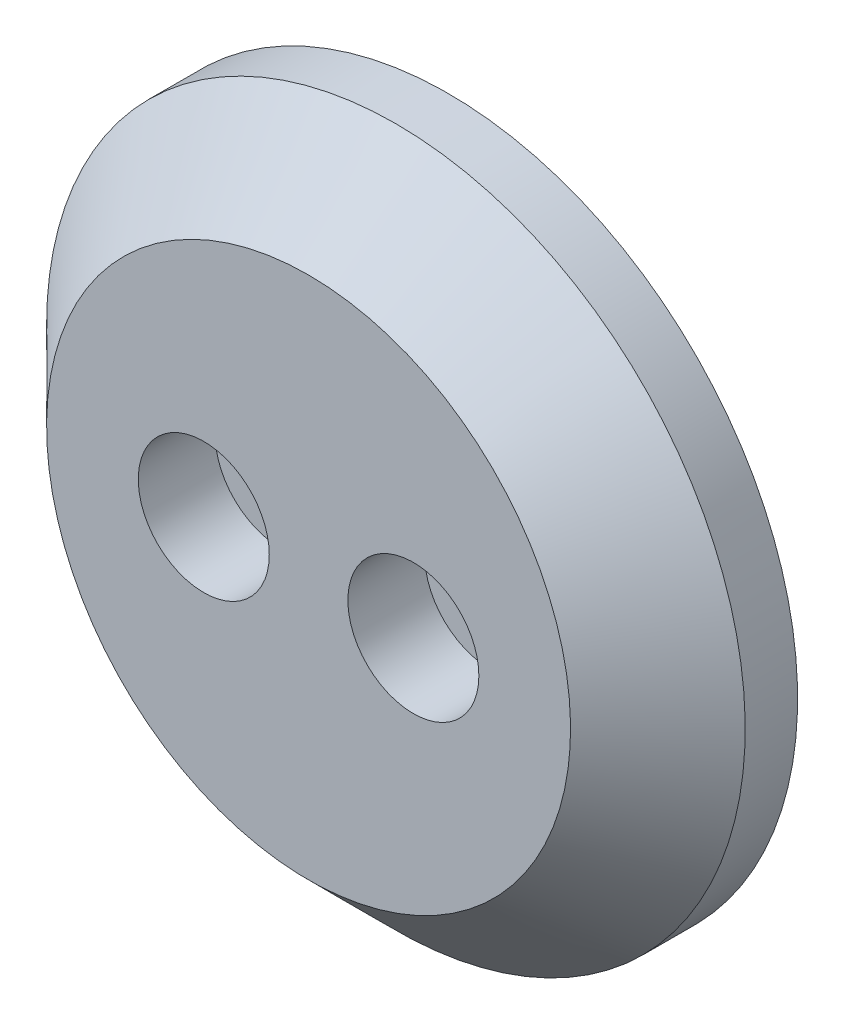
ISO-10303-21;
HEADER;
FILE_DESCRIPTION(('STEP AP214'),'2;1');
FILE_NAME('part.step','',(''),(''),'','','');
FILE_SCHEMA(('AUTOMOTIVE_DESIGN { 1 0 10303 214 1 1 1 1 }'));
ENDSEC;
DATA;
#1=APPLICATION_CONTEXT('core data for automotive mechanical design processes');
#2=APPLICATION_PROTOCOL_DEFINITION('international standard','automotive_design',2000,#1);
#3=PRODUCT_CONTEXT('',#1,'mechanical');
#4=PRODUCT('Part','Part','',(#3));
#5=PRODUCT_RELATED_PRODUCT_CATEGORY('part','',(#4));
#6=PRODUCT_DEFINITION_FORMATION('','',#4);
#7=PRODUCT_DEFINITION_CONTEXT('part definition',#1,'design');
#8=PRODUCT_DEFINITION('design','',#6,#7);
#9=PRODUCT_DEFINITION_SHAPE('','',#8);
#10=(LENGTH_UNIT() NAMED_UNIT(*) SI_UNIT(.MILLI.,.METRE.));
#11=(NAMED_UNIT(*) PLANE_ANGLE_UNIT() SI_UNIT($,.RADIAN.));
#12=(NAMED_UNIT(*) SI_UNIT($,.STERADIAN.) SOLID_ANGLE_UNIT());
#13=UNCERTAINTY_MEASURE_WITH_UNIT(LENGTH_MEASURE(1.E-05),#10,'distance_accuracy_value','');
#14=(GEOMETRIC_REPRESENTATION_CONTEXT(3) GLOBAL_UNCERTAINTY_ASSIGNED_CONTEXT((#13)) GLOBAL_UNIT_ASSIGNED_CONTEXT((#10,
#11,#12)) REPRESENTATION_CONTEXT('',''));
#15=CARTESIAN_POINT('',(0.,0.,0.));
#16=DIRECTION('',(0.,0.,1.));
#17=DIRECTION('',(1.,0.,0.));
#18=AXIS2_PLACEMENT_3D('',#15,#16,#17);
#19=CARTESIAN_POINT('',(0.,0.,8.));
#20=DIRECTION('',(0.,0.,1.));
#21=DIRECTION('',(1.,0.,0.));
#22=AXIS2_PLACEMENT_3D('',#19,#20,#21);
#23=PLANE('',#22);
#24=CARTESIAN_POINT('',(6.,0.,8.));
#25=DIRECTION('',(0.,0.,1.));
#26=DIRECTION('',(1.,0.,0.));
#27=AXIS2_PLACEMENT_3D('',#24,#25,#26);
#28=CIRCLE('',#27,3.75);
#29=CARTESIAN_POINT('',(9.75,0.,8.));
#30=VERTEX_POINT('',#29);
#31=EDGE_CURVE('E47',#30,#30,#28,.F.);
#32=ORIENTED_EDGE('',*,*,#31,.T.);
#33=EDGE_LOOP('',(#32));
#34=FACE_BOUND('',#33,.T.);
#35=CARTESIAN_POINT('',(-6.,0.,8.));
#36=DIRECTION('',(0.,0.,1.));
#37=DIRECTION('',(1.,0.,0.));
#38=AXIS2_PLACEMENT_3D('',#35,#36,#37);
#39=CIRCLE('',#38,3.75);
#40=CARTESIAN_POINT('',(-2.25,0.,8.));
#41=VERTEX_POINT('',#40);
#42=EDGE_CURVE('E17',#41,#41,#39,.F.);
#43=ORIENTED_EDGE('',*,*,#42,.T.);
#44=EDGE_LOOP('',(#43));
#45=FACE_BOUND('',#44,.T.);
#46=CARTESIAN_POINT('',(0.,0.,8.00000000000037));
#47=DIRECTION('',(0.,0.,-1.));
#48=DIRECTION('',(0.,1.,0.));
#49=AXIS2_PLACEMENT_3D('',#46,#47,#48);
#50=CIRCLE('',#49,15.0000000000004);
#51=CARTESIAN_POINT('',(0.,15.0000000000004,8.00000000000037));
#52=VERTEX_POINT('',#51);
#53=EDGE_CURVE('E45',#52,#52,#50,.T.);
#54=ORIENTED_EDGE('',*,*,#53,.F.);
#55=EDGE_LOOP('',(#54));
#56=FACE_BOUND('',#55,.T.);
#57=ADVANCED_FACE('F14',(#34,#45,#56),#23,.T.);
#58=CARTESIAN_POINT('',(-6.,0.,8.));
#59=DIRECTION('',(0.,0.,1.));
#60=DIRECTION('',(1.,0.,0.));
#61=AXIS2_PLACEMENT_3D('',#58,#59,#60);
#62=CYLINDRICAL_SURFACE('',#61,3.75);
#63=ORIENTED_EDGE('',*,*,#42,.F.);
#64=EDGE_LOOP('',(#63));
#65=FACE_BOUND('',#64,.T.);
#66=CARTESIAN_POINT('',(-6.,0.,3.6));
#67=DIRECTION('',(0.,0.,1.));
#68=DIRECTION('',(1.,0.,0.));
#69=AXIS2_PLACEMENT_3D('',#66,#67,#68);
#70=CIRCLE('',#69,3.75);
#71=CARTESIAN_POINT('',(-2.25,0.,3.6));
#72=VERTEX_POINT('',#71);
#73=EDGE_CURVE('E42',#72,#72,#70,.F.);
#74=ORIENTED_EDGE('',*,*,#73,.T.);
#75=EDGE_LOOP('',(#74));
#76=FACE_BOUND('',#75,.T.);
#77=ADVANCED_FACE('F56',(#65,#76),#62,.F.);
#78=CARTESIAN_POINT('',(6.,0.,8.));
#79=DIRECTION('',(0.,0.,1.));
#80=DIRECTION('',(1.,0.,0.));
#81=AXIS2_PLACEMENT_3D('',#78,#79,#80);
#82=CYLINDRICAL_SURFACE('',#81,3.75);
#83=ORIENTED_EDGE('',*,*,#31,.F.);
#84=EDGE_LOOP('',(#83));
#85=FACE_BOUND('',#84,.T.);
#86=CARTESIAN_POINT('',(6.,0.,3.6));
#87=DIRECTION('',(0.,0.,1.));
#88=DIRECTION('',(1.,0.,0.));
#89=AXIS2_PLACEMENT_3D('',#86,#87,#88);
#90=CIRCLE('',#89,3.75);
#91=CARTESIAN_POINT('',(9.75,0.,3.6));
#92=VERTEX_POINT('',#91);
#93=EDGE_CURVE('E39',#92,#92,#90,.F.);
#94=ORIENTED_EDGE('',*,*,#93,.T.);
#95=EDGE_LOOP('',(#94));
#96=FACE_BOUND('',#95,.T.);
#97=ADVANCED_FACE('F59',(#85,#96),#82,.F.);
#98=CARTESIAN_POINT('',(0.,0.,2.99999999999963));
#99=DIRECTION('',(0.,0.,-1.));
#100=DIRECTION('',(0.,1.,0.));
#101=AXIS2_PLACEMENT_3D('',#98,#99,#100);
#102=CONICAL_SURFACE('',#101,19.9999999999996,0.7853981633973);
#103=CARTESIAN_POINT('',(0.,0.,3.));
#104=DIRECTION('',(0.,0.,-1.));
#105=DIRECTION('',(-1.,0.,0.));
#106=AXIS2_PLACEMENT_3D('',#103,#104,#105);
#107=CIRCLE('',#106,20.);
#108=CARTESIAN_POINT('',(-20.,0.,3.));
#109=VERTEX_POINT('',#108);
#110=EDGE_CURVE('E29',#109,#109,#107,.T.);
#111=ORIENTED_EDGE('',*,*,#110,.F.);
#112=EDGE_LOOP('',(#111));
#113=FACE_BOUND('',#112,.T.);
#114=ORIENTED_EDGE('',*,*,#53,.T.);
#115=EDGE_LOOP('',(#114));
#116=FACE_BOUND('',#115,.T.);
#117=ADVANCED_FACE('F65',(#113,#116),#102,.T.);
#118=CARTESIAN_POINT('',(-3.75,0.,3.6));
#119=DIRECTION('',(0.,0.,-1.));
#120=DIRECTION('',(-1.,0.,0.));
#121=AXIS2_PLACEMENT_3D('',#118,#119,#120);
#122=PLANE('',#121);
#123=CARTESIAN_POINT('',(-6.,0.,3.6));
#124=DIRECTION('',(0.,0.,1.));
#125=DIRECTION('',(1.,0.,0.));
#126=AXIS2_PLACEMENT_3D('',#123,#124,#125);
#127=CIRCLE('',#126,2.25);
#128=CARTESIAN_POINT('',(-3.75,0.,3.6));
#129=VERTEX_POINT('',#128);
#130=EDGE_CURVE('E36',#129,#129,#127,.F.);
#131=ORIENTED_EDGE('',*,*,#130,.T.);
#132=EDGE_LOOP('',(#131));
#133=FACE_BOUND('',#132,.T.);
#134=ORIENTED_EDGE('',*,*,#73,.F.);
#135=EDGE_LOOP('',(#134));
#136=FACE_BOUND('',#135,.T.);
#137=ADVANCED_FACE('F62',(#133,#136),#122,.F.);
#138=CARTESIAN_POINT('',(8.25,0.,3.6));
#139=DIRECTION('',(0.,0.,-1.));
#140=DIRECTION('',(-1.,0.,0.));
#141=AXIS2_PLACEMENT_3D('',#138,#139,#140);
#142=PLANE('',#141);
#143=CARTESIAN_POINT('',(6.,0.,3.6));
#144=DIRECTION('',(0.,0.,1.));
#145=DIRECTION('',(1.,0.,0.));
#146=AXIS2_PLACEMENT_3D('',#143,#144,#145);
#147=CIRCLE('',#146,2.25);
#148=CARTESIAN_POINT('',(8.25,0.,3.6));
#149=VERTEX_POINT('',#148);
#150=EDGE_CURVE('E33',#149,#149,#147,.F.);
#151=ORIENTED_EDGE('',*,*,#150,.T.);
#152=EDGE_LOOP('',(#151));
#153=FACE_BOUND('',#152,.T.);
#154=ORIENTED_EDGE('',*,*,#93,.F.);
#155=EDGE_LOOP('',(#154));
#156=FACE_BOUND('',#155,.T.);
#157=ADVANCED_FACE('F64',(#153,#156),#142,.F.);
#158=CARTESIAN_POINT('',(0.,0.,8.));
#159=DIRECTION('',(0.,0.,-1.));
#160=DIRECTION('',(-1.,0.,0.));
#161=AXIS2_PLACEMENT_3D('',#158,#159,#160);
#162=CYLINDRICAL_SURFACE('',#161,20.);
#163=CARTESIAN_POINT('',(0.,0.,0.));
#164=DIRECTION('',(0.,0.,-1.));
#165=DIRECTION('',(-1.,0.,0.));
#166=AXIS2_PLACEMENT_3D('',#163,#164,#165);
#167=CIRCLE('',#166,20.);
#168=CARTESIAN_POINT('',(-20.,0.,0.));
#169=VERTEX_POINT('',#168);
#170=EDGE_CURVE('E26',#169,#169,#167,.F.);
#171=ORIENTED_EDGE('',*,*,#170,.T.);
#172=EDGE_LOOP('',(#171));
#173=FACE_BOUND('',#172,.T.);
#174=ORIENTED_EDGE('',*,*,#110,.T.);
#175=EDGE_LOOP('',(#174));
#176=FACE_BOUND('',#175,.T.);
#177=ADVANCED_FACE('F73',(#173,#176),#162,.T.);
#178=CARTESIAN_POINT('',(-6.,0.,8.));
#179=DIRECTION('',(0.,0.,1.));
#180=DIRECTION('',(1.,0.,0.));
#181=AXIS2_PLACEMENT_3D('',#178,#179,#180);
#182=CYLINDRICAL_SURFACE('',#181,2.25);
#183=ORIENTED_EDGE('',*,*,#130,.F.);
#184=EDGE_LOOP('',(#183));
#185=FACE_BOUND('',#184,.T.);
#186=CARTESIAN_POINT('',(-6.,0.,0.));
#187=DIRECTION('',(0.,0.,1.));
#188=DIRECTION('',(1.,0.,0.));
#189=AXIS2_PLACEMENT_3D('',#186,#187,#188);
#190=CIRCLE('',#189,2.25);
#191=CARTESIAN_POINT('',(-3.75,0.,0.));
#192=VERTEX_POINT('',#191);
#193=EDGE_CURVE('E21',#192,#192,#190,.F.);
#194=ORIENTED_EDGE('',*,*,#193,.T.);
#195=EDGE_LOOP('',(#194));
#196=FACE_BOUND('',#195,.T.);
#197=ADVANCED_FACE('F86',(#185,#196),#182,.F.);
#198=CARTESIAN_POINT('',(6.,0.,8.));
#199=DIRECTION('',(0.,0.,1.));
#200=DIRECTION('',(1.,0.,0.));
#201=AXIS2_PLACEMENT_3D('',#198,#199,#200);
#202=CYLINDRICAL_SURFACE('',#201,2.25);
#203=ORIENTED_EDGE('',*,*,#150,.F.);
#204=EDGE_LOOP('',(#203));
#205=FACE_BOUND('',#204,.T.);
#206=CARTESIAN_POINT('',(6.,0.,0.));
#207=DIRECTION('',(0.,0.,1.));
#208=DIRECTION('',(1.,0.,0.));
#209=AXIS2_PLACEMENT_3D('',#206,#207,#208);
#210=CIRCLE('',#209,2.25);
#211=CARTESIAN_POINT('',(8.25,0.,0.));
#212=VERTEX_POINT('',#211);
#213=EDGE_CURVE('E10',#212,#212,#210,.F.);
#214=ORIENTED_EDGE('',*,*,#213,.T.);
#215=EDGE_LOOP('',(#214));
#216=FACE_BOUND('',#215,.T.);
#217=ADVANCED_FACE('F80',(#205,#216),#202,.F.);
#218=CARTESIAN_POINT('',(0.,0.,0.));
#219=DIRECTION('',(0.,0.,1.));
#220=DIRECTION('',(1.,0.,0.));
#221=AXIS2_PLACEMENT_3D('',#218,#219,#220);
#222=PLANE('',#221);
#223=ORIENTED_EDGE('',*,*,#213,.F.);
#224=EDGE_LOOP('',(#223));
#225=FACE_BOUND('',#224,.T.);
#226=ORIENTED_EDGE('',*,*,#193,.F.);
#227=EDGE_LOOP('',(#226));
#228=FACE_BOUND('',#227,.T.);
#229=ORIENTED_EDGE('',*,*,#170,.F.);
#230=EDGE_LOOP('',(#229));
#231=FACE_BOUND('',#230,.T.);
#232=ADVANCED_FACE('F78',(#225,#228,#231),#222,.F.);
#233=CLOSED_SHELL('',(#57,#77,#97,#117,#137,#157,#177,#197,#217,#232));
#234=MANIFOLD_SOLID_BREP('B1',#233);
#235=ADVANCED_BREP_SHAPE_REPRESENTATION('',(#18,#234),#14);
#236=SHAPE_DEFINITION_REPRESENTATION(#9,#235);
ENDSEC;
END-ISO-10303-21;
